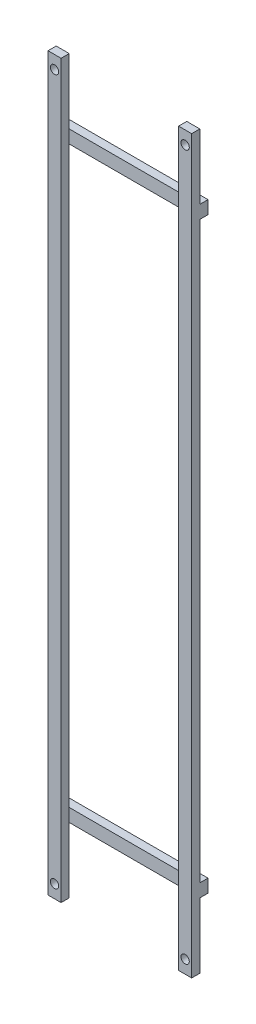
ISO-10303-21;
HEADER;
FILE_DESCRIPTION(('STEP AP214'),'2;1');
FILE_NAME('part.step','',(''),(''),'','','');
FILE_SCHEMA(('AUTOMOTIVE_DESIGN { 1 0 10303 214 1 1 1 1 }'));
ENDSEC;
DATA;
#1=APPLICATION_CONTEXT('core data for automotive mechanical design processes');
#2=APPLICATION_PROTOCOL_DEFINITION('international standard','automotive_design',2000,#1);
#3=PRODUCT_CONTEXT('',#1,'mechanical');
#4=PRODUCT('Part','Part','',(#3));
#5=PRODUCT_RELATED_PRODUCT_CATEGORY('part','',(#4));
#6=PRODUCT_DEFINITION_FORMATION('','',#4);
#7=PRODUCT_DEFINITION_CONTEXT('part definition',#1,'design');
#8=PRODUCT_DEFINITION('design','',#6,#7);
#9=PRODUCT_DEFINITION_SHAPE('','',#8);
#10=(LENGTH_UNIT() NAMED_UNIT(*) SI_UNIT(.MILLI.,.METRE.));
#11=(NAMED_UNIT(*) PLANE_ANGLE_UNIT() SI_UNIT($,.RADIAN.));
#12=(NAMED_UNIT(*) SI_UNIT($,.STERADIAN.) SOLID_ANGLE_UNIT());
#13=UNCERTAINTY_MEASURE_WITH_UNIT(LENGTH_MEASURE(1.E-05),#10,'distance_accuracy_value','');
#14=(GEOMETRIC_REPRESENTATION_CONTEXT(3) GLOBAL_UNCERTAINTY_ASSIGNED_CONTEXT((#13)) GLOBAL_UNIT_ASSIGNED_CONTEXT((#10,
#11,#12)) REPRESENTATION_CONTEXT('',''));
#15=CARTESIAN_POINT('',(0.,0.,0.));
#16=DIRECTION('',(0.,0.,1.));
#17=DIRECTION('',(1.,0.,0.));
#18=AXIS2_PLACEMENT_3D('',#15,#16,#17);
#19=CARTESIAN_POINT('',(220.,-997.383525535419,81.5788462871536));
#20=DIRECTION('',(0.,0.,1.));
#21=DIRECTION('',(1.,0.,0.));
#22=AXIS2_PLACEMENT_3D('',#19,#20,#21);
#23=PLANE('',#22);
#24=DIRECTION('',(-1.,0.,0.));
#25=VECTOR('',#24,1.);
#26=CARTESIAN_POINT('',(220.,762.616474464581,81.5788462871536));
#27=LINE('',#26,#25);
#28=CARTESIAN_POINT('',(220.,762.616474464581,81.5788462871536));
#29=VERTEX_POINT('',#28);
#30=CARTESIAN_POINT('',(180.,762.616474464581,81.5788462871536));
#31=VERTEX_POINT('',#30);
#32=EDGE_CURVE('E363',#29,#31,#27,.T.);
#33=ORIENTED_EDGE('',*,*,#32,.F.);
#34=DIRECTION('',(0.,1.,0.));
#35=VECTOR('',#34,1.);
#36=CARTESIAN_POINT('',(220.,-997.383525535419,81.5788462871536));
#37=LINE('',#36,#35);
#38=CARTESIAN_POINT('',(220.,-997.383525535419,81.5788462871536));
#39=VERTEX_POINT('',#38);
#40=EDGE_CURVE('E323',#39,#29,#37,.T.);
#41=ORIENTED_EDGE('',*,*,#40,.F.);
#42=DIRECTION('',(-1.,0.,0.));
#43=VECTOR('',#42,1.);
#44=CARTESIAN_POINT('',(220.,-997.383525535419,81.5788462871536));
#45=LINE('',#44,#43);
#46=CARTESIAN_POINT('',(180.,-997.383525535419,81.5788462871536));
#47=VERTEX_POINT('',#46);
#48=EDGE_CURVE('E326',#39,#47,#45,.T.);
#49=ORIENTED_EDGE('',*,*,#48,.T.);
#50=DIRECTION('',(0.,1.,0.));
#51=VECTOR('',#50,1.);
#52=CARTESIAN_POINT('',(180.,-997.383525535419,81.5788462871536));
#53=LINE('',#52,#51);
#54=EDGE_CURVE('E322',#47,#31,#53,.T.);
#55=ORIENTED_EDGE('',*,*,#54,.T.);
#56=EDGE_LOOP('',(#33,#41,#49,#55));
#57=FACE_BOUND('',#56,.T.);
#58=ADVANCED_FACE('F35',(#57),#23,.F.);
#59=CARTESIAN_POINT('',(200.,962.616474464581,81.5788462871535));
#60=DIRECTION('',(0.,0.,1.));
#61=DIRECTION('',(-1.,0.,0.));
#62=AXIS2_PLACEMENT_3D('',#59,#60,#61);
#63=CIRCLE('',#62,12.7);
#64=CARTESIAN_POINT('',(187.3,962.616474464581,81.5788462871535));
#65=VERTEX_POINT('',#64);
#66=EDGE_CURVE('E207',#65,#65,#63,.T.);
#67=ORIENTED_EDGE('',*,*,#66,.T.);
#68=EDGE_LOOP('',(#67));
#69=FACE_BOUND('',#68,.T.);
#70=DIRECTION('',(1.,0.,0.));
#71=VECTOR('',#70,1.);
#72=CARTESIAN_POINT('',(220.,802.616474464581,81.5788462871536));
#73=LINE('',#72,#71);
#74=CARTESIAN_POINT('',(180.,802.616474464581,81.5788462871536));
#75=VERTEX_POINT('',#74);
#76=CARTESIAN_POINT('',(220.,802.616474464581,81.5788462871536));
#77=VERTEX_POINT('',#76);
#78=EDGE_CURVE('E361',#75,#77,#73,.T.);
#79=ORIENTED_EDGE('',*,*,#78,.F.);
#80=CARTESIAN_POINT('',(180.,1002.61647446458,81.5788462871535));
#81=VERTEX_POINT('',#80);
#82=EDGE_CURVE('E317',#75,#81,#53,.T.);
#83=ORIENTED_EDGE('',*,*,#82,.T.);
#84=DIRECTION('',(-1.,0.,0.));
#85=VECTOR('',#84,1.);
#86=CARTESIAN_POINT('',(180.,1002.61647446458,81.5788462871535));
#87=LINE('',#86,#85);
#88=CARTESIAN_POINT('',(220.,1002.61647446458,81.5788462871535));
#89=VERTEX_POINT('',#88);
#90=EDGE_CURVE('E213',#89,#81,#87,.T.);
#91=ORIENTED_EDGE('',*,*,#90,.F.);
#92=EDGE_CURVE('E321',#77,#89,#37,.T.);
#93=ORIENTED_EDGE('',*,*,#92,.F.);
#94=EDGE_LOOP('',(#79,#83,#91,#93));
#95=FACE_BOUND('',#94,.T.);
#96=ADVANCED_FACE('F360',(#69,#95),#23,.F.);
#97=CARTESIAN_POINT('',(-3.45826310094282E-13,652.150576606261,81.5788462871536));
#98=DIRECTION('',(0.,0.,-1.));
#99=DIRECTION('',(-1.,0.,0.));
#100=AXIS2_PLACEMENT_3D('',#97,#98,#99);
#101=PLANE('',#100);
#102=DIRECTION('',(0.,-1.,0.));
#103=VECTOR('',#102,1.);
#104=CARTESIAN_POINT('',(-220.,-1237.38352553542,81.5788462871536));
#105=LINE('',#104,#103);
#106=CARTESIAN_POINT('',(-220.,762.616474464581,81.5788462871536));
#107=VERTEX_POINT('',#106);
#108=CARTESIAN_POINT('',(-220.,-997.383525535419,81.5788462871536));
#109=VERTEX_POINT('',#108);
#110=EDGE_CURVE('E275',#107,#109,#105,.T.);
#111=ORIENTED_EDGE('',*,*,#110,.F.);
#112=CARTESIAN_POINT('',(-180.,762.616474464581,81.5788462871536));
#113=VERTEX_POINT('',#112);
#114=EDGE_CURVE('E198',#113,#107,#27,.T.);
#115=ORIENTED_EDGE('',*,*,#114,.F.);
#116=DIRECTION('',(0.,1.,0.));
#117=VECTOR('',#116,1.);
#118=CARTESIAN_POINT('',(-180.,602.616474464581,81.5788462871536));
#119=LINE('',#118,#117);
#120=CARTESIAN_POINT('',(-180.,-997.383525535419,81.5788462871536));
#121=VERTEX_POINT('',#120);
#122=EDGE_CURVE('E383',#121,#113,#119,.T.);
#123=ORIENTED_EDGE('',*,*,#122,.F.);
#124=DIRECTION('',(1.,0.,0.));
#125=VECTOR('',#124,1.);
#126=CARTESIAN_POINT('',(-220.,-997.383525535419,81.5788462871536));
#127=LINE('',#126,#125);
#128=EDGE_CURVE('E301',#109,#121,#127,.T.);
#129=ORIENTED_EDGE('',*,*,#128,.F.);
#130=EDGE_LOOP('',(#111,#115,#123,#129));
#131=FACE_BOUND('',#130,.T.);
#132=ADVANCED_FACE('F381',(#131),#101,.T.);
#133=CARTESIAN_POINT('',(-200.,962.616474464581,81.5788462871535));
#134=DIRECTION('',(0.,0.,1.));
#135=DIRECTION('',(-1.,0.,0.));
#136=AXIS2_PLACEMENT_3D('',#133,#134,#135);
#137=CIRCLE('',#136,12.7000000000001);
#138=CARTESIAN_POINT('',(-212.7,962.616474464581,81.5788462871535));
#139=VERTEX_POINT('',#138);
#140=EDGE_CURVE('E225',#139,#139,#137,.T.);
#141=ORIENTED_EDGE('',*,*,#140,.T.);
#142=EDGE_LOOP('',(#141));
#143=FACE_BOUND('',#142,.T.);
#144=CARTESIAN_POINT('',(-180.,802.616474464581,81.5788462871536));
#145=VERTEX_POINT('',#144);
#146=CARTESIAN_POINT('',(-180.,1002.61647446458,81.5788462871535));
#147=VERTEX_POINT('',#146);
#148=EDGE_CURVE('E280',#145,#147,#119,.T.);
#149=ORIENTED_EDGE('',*,*,#148,.F.);
#150=CARTESIAN_POINT('',(-220.,802.616474464581,81.5788462871536));
#151=VERTEX_POINT('',#150);
#152=EDGE_CURVE('E59',#151,#145,#73,.T.);
#153=ORIENTED_EDGE('',*,*,#152,.F.);
#154=CARTESIAN_POINT('',(-220.,1002.61647446458,81.5788462871535));
#155=VERTEX_POINT('',#154);
#156=EDGE_CURVE('E276',#155,#151,#105,.T.);
#157=ORIENTED_EDGE('',*,*,#156,.F.);
#158=DIRECTION('',(-1.,0.,0.));
#159=VECTOR('',#158,1.);
#160=CARTESIAN_POINT('',(-220.,1002.61647446458,81.5788462871535));
#161=LINE('',#160,#159);
#162=EDGE_CURVE('E231',#147,#155,#161,.T.);
#163=ORIENTED_EDGE('',*,*,#162,.F.);
#164=EDGE_LOOP('',(#149,#153,#157,#163));
#165=FACE_BOUND('',#164,.T.);
#166=ADVANCED_FACE('F398',(#143,#165),#101,.T.);
#167=CARTESIAN_POINT('',(-220.,-997.383525535419,81.5788462871536));
#168=DIRECTION('',(0.,0.,-1.));
#169=DIRECTION('',(0.,1.,0.));
#170=AXIS2_PLACEMENT_3D('',#167,#168,#169);
#171=PLANE('',#170);
#172=CARTESIAN_POINT('',(-180.,-1037.38352553542,81.5788462871536));
#173=VERTEX_POINT('',#172);
#174=EDGE_CURVE('E285',#173,#121,#119,.T.);
#175=ORIENTED_EDGE('',*,*,#174,.F.);
#176=DIRECTION('',(1.,0.,0.));
#177=VECTOR('',#176,1.);
#178=CARTESIAN_POINT('',(-220.,-1037.38352553542,81.5788462871536));
#179=LINE('',#178,#177);
#180=CARTESIAN_POINT('',(180.,-1037.38352553542,81.5788462871535));
#181=VERTEX_POINT('',#180);
#182=EDGE_CURVE('E295',#173,#181,#179,.T.);
#183=ORIENTED_EDGE('',*,*,#182,.T.);
#184=DIRECTION('',(0.,1.,0.));
#185=VECTOR('',#184,1.);
#186=CARTESIAN_POINT('',(180.,-997.383525535419,81.5788462871536));
#187=LINE('',#186,#185);
#188=EDGE_CURVE('E289',#181,#47,#187,.T.);
#189=ORIENTED_EDGE('',*,*,#188,.T.);
#190=EDGE_CURVE('E300',#121,#47,#127,.T.);
#191=ORIENTED_EDGE('',*,*,#190,.F.);
#192=EDGE_LOOP('',(#175,#183,#189,#191));
#193=FACE_BOUND('',#192,.T.);
#194=ADVANCED_FACE('F420',(#193),#171,.F.);
#195=CARTESIAN_POINT('',(180.,652.150576606261,-198.421153712846));
#196=DIRECTION('',(-1.,0.,0.));
#197=DIRECTION('',(0.,0.,1.));
#198=AXIS2_PLACEMENT_3D('',#195,#196,#197);
#199=PLANE('',#198);
#200=DIRECTION('',(0.,-1.,0.));
#201=VECTOR('',#200,1.);
#202=CARTESIAN_POINT('',(180.,652.150576606261,106.578846287154));
#203=LINE('',#202,#201);
#204=CARTESIAN_POINT('',(180.,1002.61647446458,106.578846287154));
#205=VERTEX_POINT('',#204);
#206=CARTESIAN_POINT('',(180.,-1237.38352553542,106.578846287153));
#207=VERTEX_POINT('',#206);
#208=EDGE_CURVE('E254',#205,#207,#203,.T.);
#209=ORIENTED_EDGE('',*,*,#208,.F.);
#210=DIRECTION('',(0.,0.,1.));
#211=VECTOR('',#210,1.);
#212=CARTESIAN_POINT('',(180.,1002.61647446458,81.5788462871535));
#213=LINE('',#212,#211);
#214=EDGE_CURVE('E219',#81,#205,#213,.T.);
#215=ORIENTED_EDGE('',*,*,#214,.F.);
#216=ORIENTED_EDGE('',*,*,#82,.F.);
#217=DIRECTION('',(0.,-1.,0.));
#218=VECTOR('',#217,1.);
#219=CARTESIAN_POINT('',(180.,652.150576606261,81.5788462871536));
#220=LINE('',#219,#218);
#221=EDGE_CURVE('E199',#75,#31,#220,.T.);
#222=ORIENTED_EDGE('',*,*,#221,.T.);
#223=ORIENTED_EDGE('',*,*,#54,.F.);
#224=ORIENTED_EDGE('',*,*,#188,.F.);
#225=DIRECTION('',(0.,1.,0.));
#226=VECTOR('',#225,1.);
#227=CARTESIAN_POINT('',(180.,-1237.38352553542,81.5788462871535));
#228=LINE('',#227,#226);
#229=CARTESIAN_POINT('',(180.,-1237.38352553542,81.5788462871535));
#230=VERTEX_POINT('',#229);
#231=EDGE_CURVE('E304',#230,#181,#228,.T.);
#232=ORIENTED_EDGE('',*,*,#231,.F.);
#233=DIRECTION('',(0.,0.,1.));
#234=VECTOR('',#233,1.);
#235=CARTESIAN_POINT('',(180.,-1237.38352553542,-198.421153712846));
#236=LINE('',#235,#234);
#237=EDGE_CURVE('E331',#230,#207,#236,.T.);
#238=ORIENTED_EDGE('',*,*,#237,.T.);
#239=EDGE_LOOP('',(#209,#215,#216,#222,#223,#224,#232,#238));
#240=FACE_BOUND('',#239,.T.);
#241=ADVANCED_FACE('F338',(#240),#199,.T.);
#242=CARTESIAN_POINT('',(220.,-1237.38352553542,-198.421153712846));
#243=DIRECTION('',(0.,-1.,0.));
#244=DIRECTION('',(0.,0.,-1.));
#245=AXIS2_PLACEMENT_3D('',#242,#243,#244);
#246=PLANE('',#245);
#247=DIRECTION('',(1.,0.,0.));
#248=VECTOR('',#247,1.);
#249=CARTESIAN_POINT('',(220.,-1237.38352553542,106.578846287153));
#250=LINE('',#249,#248);
#251=CARTESIAN_POINT('',(220.,-1237.38352553542,106.578846287154));
#252=VERTEX_POINT('',#251);
#253=EDGE_CURVE('E256',#207,#252,#250,.T.);
#254=ORIENTED_EDGE('',*,*,#253,.F.);
#255=ORIENTED_EDGE('',*,*,#237,.F.);
#256=DIRECTION('',(-1.,0.,0.));
#257=VECTOR('',#256,1.);
#258=CARTESIAN_POINT('',(220.,-1237.38352553542,81.5788462871535));
#259=LINE('',#258,#257);
#260=CARTESIAN_POINT('',(220.,-1237.38352553542,81.5788462871535));
#261=VERTEX_POINT('',#260);
#262=EDGE_CURVE('E311',#261,#230,#259,.T.);
#263=ORIENTED_EDGE('',*,*,#262,.F.);
#264=DIRECTION('',(0.,0.,1.));
#265=VECTOR('',#264,1.);
#266=CARTESIAN_POINT('',(220.,-1237.38352553542,-198.421153712846));
#267=LINE('',#266,#265);
#268=EDGE_CURVE('E44',#261,#252,#267,.T.);
#269=ORIENTED_EDGE('',*,*,#268,.T.);
#270=EDGE_LOOP('',(#254,#255,#263,#269));
#271=FACE_BOUND('',#270,.T.);
#272=ADVANCED_FACE('F37',(#271),#246,.T.);
#273=CARTESIAN_POINT('',(220.,652.150576606261,-198.421153712846));
#274=DIRECTION('',(-1.,0.,0.));
#275=DIRECTION('',(0.,0.,1.));
#276=AXIS2_PLACEMENT_3D('',#273,#274,#275);
#277=PLANE('',#276);
#278=ORIENTED_EDGE('',*,*,#40,.T.);
#279=DIRECTION('',(0.,0.,1.));
#280=VECTOR('',#279,1.);
#281=CARTESIAN_POINT('',(220.,762.616474464581,56.5788462871536));
#282=LINE('',#281,#280);
#283=CARTESIAN_POINT('',(220.,762.616474464581,56.5788462871536));
#284=VERTEX_POINT('',#283);
#285=EDGE_CURVE('E369',#284,#29,#282,.T.);
#286=ORIENTED_EDGE('',*,*,#285,.F.);
#287=DIRECTION('',(0.,-1.,0.));
#288=VECTOR('',#287,1.);
#289=CARTESIAN_POINT('',(220.,762.616474464581,56.5788462871536));
#290=LINE('',#289,#288);
#291=CARTESIAN_POINT('',(220.,802.616474464581,56.5788462871536));
#292=VERTEX_POINT('',#291);
#293=EDGE_CURVE('E190',#292,#284,#290,.T.);
#294=ORIENTED_EDGE('',*,*,#293,.F.);
#295=DIRECTION('',(0.,0.,1.));
#296=VECTOR('',#295,1.);
#297=CARTESIAN_POINT('',(220.,802.616474464581,56.5788462871536));
#298=LINE('',#297,#296);
#299=EDGE_CURVE('E51',#292,#77,#298,.T.);
#300=ORIENTED_EDGE('',*,*,#299,.T.);
#301=ORIENTED_EDGE('',*,*,#92,.T.);
#302=DIRECTION('',(0.,0.,1.));
#303=VECTOR('',#302,1.);
#304=CARTESIAN_POINT('',(220.,1002.61647446458,81.5788462871535));
#305=LINE('',#304,#303);
#306=CARTESIAN_POINT('',(220.,1002.61647446458,106.578846287154));
#307=VERTEX_POINT('',#306);
#308=EDGE_CURVE('E216',#89,#307,#305,.T.);
#309=ORIENTED_EDGE('',*,*,#308,.T.);
#310=DIRECTION('',(0.,1.,0.));
#311=VECTOR('',#310,1.);
#312=CARTESIAN_POINT('',(220.,823.041268335871,106.578846287154));
#313=LINE('',#312,#311);
#314=EDGE_CURVE('E240',#252,#307,#313,.T.);
#315=ORIENTED_EDGE('',*,*,#314,.F.);
#316=ORIENTED_EDGE('',*,*,#268,.F.);
#317=DIRECTION('',(0.,1.,0.));
#318=VECTOR('',#317,1.);
#319=CARTESIAN_POINT('',(220.,-1237.38352553542,81.5788462871535));
#320=LINE('',#319,#318);
#321=CARTESIAN_POINT('',(220.,-1037.38352553542,81.5788462871535));
#322=VERTEX_POINT('',#321);
#323=EDGE_CURVE('E305',#261,#322,#320,.T.);
#324=ORIENTED_EDGE('',*,*,#323,.T.);
#325=DIRECTION('',(0.,0.,-1.));
#326=VECTOR('',#325,1.);
#327=CARTESIAN_POINT('',(220.,-1037.38352553542,81.5788462871535));
#328=LINE('',#327,#326);
#329=CARTESIAN_POINT('',(220.,-1037.38352553542,56.5788462871538));
#330=VERTEX_POINT('',#329);
#331=EDGE_CURVE('E308',#322,#330,#328,.T.);
#332=ORIENTED_EDGE('',*,*,#331,.T.);
#333=DIRECTION('',(0.,-1.,0.));
#334=VECTOR('',#333,1.);
#335=CARTESIAN_POINT('',(220.,866.387601976079,56.5788462871538));
#336=LINE('',#335,#334);
#337=CARTESIAN_POINT('',(220.,-997.38352553542,56.5788462871535));
#338=VERTEX_POINT('',#337);
#339=EDGE_CURVE('E258',#338,#330,#336,.T.);
#340=ORIENTED_EDGE('',*,*,#339,.F.);
#341=DIRECTION('',(0.,0.,1.));
#342=VECTOR('',#341,1.);
#343=CARTESIAN_POINT('',(220.,-997.383525535419,-198.421153712846));
#344=LINE('',#343,#342);
#345=EDGE_CURVE('E319',#338,#39,#344,.T.);
#346=ORIENTED_EDGE('',*,*,#345,.T.);
#347=EDGE_LOOP('',(#278,#286,#294,#300,#301,#309,#315,#316,#324,#332,#340,#346));
#348=FACE_BOUND('',#347,.T.);
#349=ADVANCED_FACE('F349',(#348),#277,.F.);
#350=CARTESIAN_POINT('',(220.,-997.383525535419,-198.421153712846));
#351=DIRECTION('',(0.,-1.,0.));
#352=DIRECTION('',(1.,0.,0.));
#353=AXIS2_PLACEMENT_3D('',#350,#351,#352);
#354=PLANE('',#353);
#355=ORIENTED_EDGE('',*,*,#345,.F.);
#356=DIRECTION('',(-1.,0.,0.));
#357=VECTOR('',#356,1.);
#358=CARTESIAN_POINT('',(220.,-997.383525535419,56.5788462871535));
#359=LINE('',#358,#357);
#360=CARTESIAN_POINT('',(-220.,-997.383525535419,56.5788462871536));
#361=VERTEX_POINT('',#360);
#362=EDGE_CURVE('E263',#338,#361,#359,.T.);
#363=ORIENTED_EDGE('',*,*,#362,.T.);
#364=DIRECTION('',(0.,0.,-1.));
#365=VECTOR('',#364,1.);
#366=CARTESIAN_POINT('',(-220.,-997.383525535419,-198.421153712846));
#367=LINE('',#366,#365);
#368=EDGE_CURVE('E290',#109,#361,#367,.T.);
#369=ORIENTED_EDGE('',*,*,#368,.F.);
#370=ORIENTED_EDGE('',*,*,#128,.T.);
#371=ORIENTED_EDGE('',*,*,#190,.T.);
#372=ORIENTED_EDGE('',*,*,#48,.F.);
#373=EDGE_LOOP('',(#355,#363,#369,#370,#371,#372));
#374=FACE_BOUND('',#373,.T.);
#375=ADVANCED_FACE('F423',(#374),#354,.F.);
#376=CARTESIAN_POINT('',(-220.,652.150576606261,-198.421153712846));
#377=DIRECTION('',(1.,0.,0.));
#378=DIRECTION('',(0.,0.,-1.));
#379=AXIS2_PLACEMENT_3D('',#376,#377,#378);
#380=PLANE('',#379);
#381=DIRECTION('',(0.,1.,0.));
#382=VECTOR('',#381,1.);
#383=CARTESIAN_POINT('',(-220.,652.150576606261,106.578846287154));
#384=LINE('',#383,#382);
#385=CARTESIAN_POINT('',(-220.,-1237.38352553542,106.578846287153));
#386=VERTEX_POINT('',#385);
#387=CARTESIAN_POINT('',(-220.,1002.61647446458,106.578846287154));
#388=VERTEX_POINT('',#387);
#389=EDGE_CURVE('E252',#386,#388,#384,.T.);
#390=ORIENTED_EDGE('',*,*,#389,.T.);
#391=DIRECTION('',(0.,0.,1.));
#392=VECTOR('',#391,1.);
#393=CARTESIAN_POINT('',(-220.,1002.61647446458,81.5788462871535));
#394=LINE('',#393,#392);
#395=EDGE_CURVE('E237',#155,#388,#394,.T.);
#396=ORIENTED_EDGE('',*,*,#395,.F.);
#397=ORIENTED_EDGE('',*,*,#156,.T.);
#398=DIRECTION('',(0.,0.,1.));
#399=VECTOR('',#398,1.);
#400=CARTESIAN_POINT('',(-220.,802.616474464581,56.5788462871536));
#401=LINE('',#400,#399);
#402=CARTESIAN_POINT('',(-220.,802.616474464581,56.5788462871536));
#403=VERTEX_POINT('',#402);
#404=EDGE_CURVE('E182',#403,#151,#401,.T.);
#405=ORIENTED_EDGE('',*,*,#404,.F.);
#406=DIRECTION('',(0.,1.,0.));
#407=VECTOR('',#406,1.);
#408=CARTESIAN_POINT('',(-220.,762.616474464581,56.5788462871536));
#409=LINE('',#408,#407);
#410=CARTESIAN_POINT('',(-220.,762.616474464581,56.5788462871536));
#411=VERTEX_POINT('',#410);
#412=EDGE_CURVE('E175',#411,#403,#409,.T.);
#413=ORIENTED_EDGE('',*,*,#412,.F.);
#414=DIRECTION('',(0.,0.,1.));
#415=VECTOR('',#414,1.);
#416=CARTESIAN_POINT('',(-220.,762.616474464581,56.5788462871536));
#417=LINE('',#416,#415);
#418=EDGE_CURVE('E179',#411,#107,#417,.T.);
#419=ORIENTED_EDGE('',*,*,#418,.T.);
#420=ORIENTED_EDGE('',*,*,#110,.T.);
#421=ORIENTED_EDGE('',*,*,#368,.T.);
#422=DIRECTION('',(0.,-1.,0.));
#423=VECTOR('',#422,1.);
#424=CARTESIAN_POINT('',(-220.,652.150576606261,56.5788462871538));
#425=LINE('',#424,#423);
#426=CARTESIAN_POINT('',(-220.,-1037.38352553542,56.5788462871535));
#427=VERTEX_POINT('',#426);
#428=EDGE_CURVE('E260',#361,#427,#425,.T.);
#429=ORIENTED_EDGE('',*,*,#428,.T.);
#430=DIRECTION('',(0.,0.,1.));
#431=VECTOR('',#430,1.);
#432=CARTESIAN_POINT('',(-220.,-1037.38352553542,81.5788462871536));
#433=LINE('',#432,#431);
#434=CARTESIAN_POINT('',(-220.,-1037.38352553542,81.5788462871536));
#435=VERTEX_POINT('',#434);
#436=EDGE_CURVE('E293',#427,#435,#433,.T.);
#437=ORIENTED_EDGE('',*,*,#436,.T.);
#438=CARTESIAN_POINT('',(-220.,-1237.38352553542,81.5788462871536));
#439=VERTEX_POINT('',#438);
#440=EDGE_CURVE('E272',#435,#439,#105,.T.);
#441=ORIENTED_EDGE('',*,*,#440,.T.);
#442=DIRECTION('',(0.,0.,-1.));
#443=VECTOR('',#442,1.);
#444=CARTESIAN_POINT('',(-220.,-1237.38352553542,121.578846287154));
#445=LINE('',#444,#443);
#446=EDGE_CURVE('E287',#386,#439,#445,.T.);
#447=ORIENTED_EDGE('',*,*,#446,.F.);
#448=EDGE_LOOP('',(#390,#396,#397,#405,#413,#419,#420,#421,#429,#437,#441,#447));
#449=FACE_BOUND('',#448,.T.);
#450=ADVANCED_FACE('F177',(#449),#380,.F.);
#451=CARTESIAN_POINT('',(220.,-1037.38352553542,81.5788462871535));
#452=DIRECTION('',(0.,1.,0.));
#453=DIRECTION('',(-1.,0.,0.));
#454=AXIS2_PLACEMENT_3D('',#451,#452,#453);
#455=PLANE('',#454);
#456=ORIENTED_EDGE('',*,*,#436,.F.);
#457=DIRECTION('',(1.,0.,0.));
#458=VECTOR('',#457,1.);
#459=CARTESIAN_POINT('',(220.,-1037.38352553542,56.5788462871535));
#460=LINE('',#459,#458);
#461=EDGE_CURVE('E11',#427,#330,#460,.T.);
#462=ORIENTED_EDGE('',*,*,#461,.T.);
#463=ORIENTED_EDGE('',*,*,#331,.F.);
#464=DIRECTION('',(-1.,0.,0.));
#465=VECTOR('',#464,1.);
#466=CARTESIAN_POINT('',(220.,-1037.38352553542,81.5788462871535));
#467=LINE('',#466,#465);
#468=EDGE_CURVE('E314',#322,#181,#467,.T.);
#469=ORIENTED_EDGE('',*,*,#468,.T.);
#470=ORIENTED_EDGE('',*,*,#182,.F.);
#471=EDGE_CURVE('E298',#435,#173,#179,.T.);
#472=ORIENTED_EDGE('',*,*,#471,.F.);
#473=EDGE_LOOP('',(#456,#462,#463,#469,#470,#472));
#474=FACE_BOUND('',#473,.T.);
#475=ADVANCED_FACE('F417',(#474),#455,.F.);
#476=CARTESIAN_POINT('',(220.,-1237.38352553542,81.5788462871535));
#477=DIRECTION('',(0.,0.,1.));
#478=DIRECTION('',(1.,0.,0.));
#479=AXIS2_PLACEMENT_3D('',#476,#477,#478);
#480=PLANE('',#479);
#481=CARTESIAN_POINT('',(200.,-1197.38352553542,81.5788462871535));
#482=DIRECTION('',(0.,0.,1.));
#483=DIRECTION('',(1.,0.,0.));
#484=AXIS2_PLACEMENT_3D('',#481,#482,#483);
#485=CIRCLE('',#484,12.7);
#486=CARTESIAN_POINT('',(212.7,-1197.38352553542,81.5788462871535));
#487=VERTEX_POINT('',#486);
#488=EDGE_CURVE('E266',#487,#487,#485,.T.);
#489=ORIENTED_EDGE('',*,*,#488,.T.);
#490=EDGE_LOOP('',(#489));
#491=FACE_BOUND('',#490,.T.);
#492=ORIENTED_EDGE('',*,*,#231,.T.);
#493=ORIENTED_EDGE('',*,*,#468,.F.);
#494=ORIENTED_EDGE('',*,*,#323,.F.);
#495=ORIENTED_EDGE('',*,*,#262,.T.);
#496=EDGE_LOOP('',(#492,#493,#494,#495));
#497=FACE_BOUND('',#496,.T.);
#498=ADVANCED_FACE('F427',(#491,#497),#480,.F.);
#499=CARTESIAN_POINT('',(-200.,-1197.38352553542,81.5788462871536));
#500=DIRECTION('',(0.,0.,-1.));
#501=DIRECTION('',(0.,1.,0.));
#502=AXIS2_PLACEMENT_3D('',#499,#500,#501);
#503=CIRCLE('',#502,12.7);
#504=CARTESIAN_POINT('',(-200.,-1184.68352553542,81.5788462871536));
#505=VERTEX_POINT('',#504);
#506=EDGE_CURVE('E269',#505,#505,#503,.T.);
#507=ORIENTED_EDGE('',*,*,#506,.F.);
#508=EDGE_LOOP('',(#507));
#509=FACE_BOUND('',#508,.T.);
#510=ORIENTED_EDGE('',*,*,#471,.T.);
#511=CARTESIAN_POINT('',(-180.,-1237.38352553542,81.5788462871536));
#512=VERTEX_POINT('',#511);
#513=EDGE_CURVE('E281',#512,#173,#119,.T.);
#514=ORIENTED_EDGE('',*,*,#513,.F.);
#515=DIRECTION('',(1.,0.,0.));
#516=VECTOR('',#515,1.);
#517=CARTESIAN_POINT('',(-180.,-1237.38352553542,81.5788462871536));
#518=LINE('',#517,#516);
#519=EDGE_CURVE('E277',#439,#512,#518,.T.);
#520=ORIENTED_EDGE('',*,*,#519,.F.);
#521=ORIENTED_EDGE('',*,*,#440,.F.);
#522=EDGE_LOOP('',(#510,#514,#520,#521));
#523=FACE_BOUND('',#522,.T.);
#524=ADVANCED_FACE('F412',(#509,#523),#101,.T.);
#525=CARTESIAN_POINT('',(-180.,-1237.38352553542,121.578846287154));
#526=DIRECTION('',(0.,1.,0.));
#527=DIRECTION('',(0.,0.,1.));
#528=AXIS2_PLACEMENT_3D('',#525,#526,#527);
#529=PLANE('',#528);
#530=DIRECTION('',(0.,0.,-1.));
#531=VECTOR('',#530,1.);
#532=CARTESIAN_POINT('',(-180.,-1237.38352553542,121.578846287154));
#533=LINE('',#532,#531);
#534=CARTESIAN_POINT('',(-180.,-1237.38352553542,106.578846287153));
#535=VERTEX_POINT('',#534);
#536=EDGE_CURVE('E284',#535,#512,#533,.T.);
#537=ORIENTED_EDGE('',*,*,#536,.F.);
#538=DIRECTION('',(-1.,0.,0.));
#539=VECTOR('',#538,1.);
#540=CARTESIAN_POINT('',(-180.,-1237.38352553542,106.578846287153));
#541=LINE('',#540,#539);
#542=EDGE_CURVE('E249',#535,#386,#541,.T.);
#543=ORIENTED_EDGE('',*,*,#542,.T.);
#544=ORIENTED_EDGE('',*,*,#446,.T.);
#545=ORIENTED_EDGE('',*,*,#519,.T.);
#546=EDGE_LOOP('',(#537,#543,#544,#545));
#547=FACE_BOUND('',#546,.T.);
#548=ADVANCED_FACE('F409',(#547),#529,.F.);
#549=CARTESIAN_POINT('',(-180.,602.616474464581,121.578846287154));
#550=DIRECTION('',(-1.,0.,0.));
#551=DIRECTION('',(0.,0.,1.));
#552=AXIS2_PLACEMENT_3D('',#549,#550,#551);
#553=PLANE('',#552);
#554=ORIENTED_EDGE('',*,*,#122,.T.);
#555=EDGE_CURVE('E388',#113,#145,#119,.T.);
#556=ORIENTED_EDGE('',*,*,#555,.T.);
#557=ORIENTED_EDGE('',*,*,#148,.T.);
#558=DIRECTION('',(0.,0.,1.));
#559=VECTOR('',#558,1.);
#560=CARTESIAN_POINT('',(-180.,1002.61647446458,81.5788462871535));
#561=LINE('',#560,#559);
#562=CARTESIAN_POINT('',(-180.,1002.61647446458,106.578846287154));
#563=VERTEX_POINT('',#562);
#564=EDGE_CURVE('E234',#147,#563,#561,.T.);
#565=ORIENTED_EDGE('',*,*,#564,.T.);
#566=DIRECTION('',(0.,-1.,0.));
#567=VECTOR('',#566,1.);
#568=CARTESIAN_POINT('',(-180.,602.616474464581,106.578846287154));
#569=LINE('',#568,#567);
#570=EDGE_CURVE('E247',#563,#535,#569,.T.);
#571=ORIENTED_EDGE('',*,*,#570,.T.);
#572=ORIENTED_EDGE('',*,*,#536,.T.);
#573=ORIENTED_EDGE('',*,*,#513,.T.);
#574=ORIENTED_EDGE('',*,*,#174,.T.);
#575=EDGE_LOOP('',(#554,#556,#557,#565,#571,#572,#573,#574));
#576=FACE_BOUND('',#575,.T.);
#577=ADVANCED_FACE('F387',(#576),#553,.F.);
#578=CARTESIAN_POINT('',(-200.,-1197.38352553542,81.5788462871536));
#579=DIRECTION('',(0.,0.,-1.));
#580=DIRECTION('',(0.,1.,0.));
#581=AXIS2_PLACEMENT_3D('',#578,#579,#580);
#582=CYLINDRICAL_SURFACE('',#581,12.7);
#583=CARTESIAN_POINT('',(-200.,-1197.38352553542,106.578846287153));
#584=DIRECTION('',(0.,0.,-1.));
#585=DIRECTION('',(0.,1.,0.));
#586=AXIS2_PLACEMENT_3D('',#583,#584,#585);
#587=CIRCLE('',#586,12.7);
#588=CARTESIAN_POINT('',(-200.,-1184.68352553542,106.578846287153));
#589=VERTEX_POINT('',#588);
#590=EDGE_CURVE('E244',#589,#589,#587,.F.);
#591=ORIENTED_EDGE('',*,*,#590,.T.);
#592=EDGE_LOOP('',(#591));
#593=FACE_BOUND('',#592,.T.);
#594=ORIENTED_EDGE('',*,*,#506,.T.);
#595=EDGE_LOOP('',(#594));
#596=FACE_BOUND('',#595,.T.);
#597=ADVANCED_FACE('F463',(#593,#596),#582,.F.);
#598=CARTESIAN_POINT('',(200.,-1197.38352553542,121.578846287154));
#599=DIRECTION('',(0.,0.,1.));
#600=DIRECTION('',(1.,0.,0.));
#601=AXIS2_PLACEMENT_3D('',#598,#599,#600);
#602=CYLINDRICAL_SURFACE('',#601,12.7);
#603=CARTESIAN_POINT('',(200.,-1197.38352553542,106.578846287153));
#604=DIRECTION('',(0.,0.,-1.));
#605=DIRECTION('',(0.,1.,0.));
#606=AXIS2_PLACEMENT_3D('',#603,#604,#605);
#607=CIRCLE('',#606,12.7);
#608=CARTESIAN_POINT('',(200.,-1184.68352553542,106.578846287153));
#609=VERTEX_POINT('',#608);
#610=EDGE_CURVE('E39',#609,#609,#607,.F.);
#611=ORIENTED_EDGE('',*,*,#610,.T.);
#612=EDGE_LOOP('',(#611));
#613=FACE_BOUND('',#612,.T.);
#614=ORIENTED_EDGE('',*,*,#488,.F.);
#615=EDGE_LOOP('',(#614));
#616=FACE_BOUND('',#615,.T.);
#617=ADVANCED_FACE('F468',(#613,#616),#602,.F.);
#618=CARTESIAN_POINT('',(-380.000000000001,866.387601976079,56.5788462871538));
#619=DIRECTION('',(0.,0.,1.));
#620=DIRECTION('',(0.,-1.,0.));
#621=AXIS2_PLACEMENT_3D('',#618,#619,#620);
#622=PLANE('',#621);
#623=ORIENTED_EDGE('',*,*,#339,.T.);
#624=ORIENTED_EDGE('',*,*,#461,.F.);
#625=ORIENTED_EDGE('',*,*,#428,.F.);
#626=ORIENTED_EDGE('',*,*,#362,.F.);
#627=EDGE_LOOP('',(#623,#624,#625,#626));
#628=FACE_BOUND('',#627,.T.);
#629=ADVANCED_FACE('F425',(#628),#622,.F.);
#630=CARTESIAN_POINT('',(-380.000000000001,823.041268335871,106.578846287154));
#631=DIRECTION('',(0.,0.,-1.));
#632=DIRECTION('',(0.,1.,0.));
#633=AXIS2_PLACEMENT_3D('',#630,#631,#632);
#634=PLANE('',#633);
#635=ORIENTED_EDGE('',*,*,#314,.T.);
#636=DIRECTION('',(-1.,0.,0.));
#637=VECTOR('',#636,1.);
#638=CARTESIAN_POINT('',(180.,1002.61647446458,106.578846287154));
#639=LINE('',#638,#637);
#640=EDGE_CURVE('E210',#307,#205,#639,.T.);
#641=ORIENTED_EDGE('',*,*,#640,.T.);
#642=ORIENTED_EDGE('',*,*,#208,.T.);
#643=ORIENTED_EDGE('',*,*,#253,.T.);
#644=EDGE_LOOP('',(#635,#641,#642,#643));
#645=FACE_BOUND('',#644,.T.);
#646=ORIENTED_EDGE('',*,*,#610,.F.);
#647=EDGE_LOOP('',(#646));
#648=FACE_BOUND('',#647,.T.);
#649=CARTESIAN_POINT('',(200.,962.616474464581,106.578846287154));
#650=DIRECTION('',(0.,0.,1.));
#651=DIRECTION('',(-1.,0.,0.));
#652=AXIS2_PLACEMENT_3D('',#649,#650,#651);
#653=CIRCLE('',#652,12.7);
#654=CARTESIAN_POINT('',(187.3,962.616474464581,106.578846287154));
#655=VERTEX_POINT('',#654);
#656=EDGE_CURVE('E202',#655,#655,#653,.T.);
#657=ORIENTED_EDGE('',*,*,#656,.F.);
#658=EDGE_LOOP('',(#657));
#659=FACE_BOUND('',#658,.T.);
#660=ADVANCED_FACE('F347',(#645,#648,#659),#634,.F.);
#661=ORIENTED_EDGE('',*,*,#590,.F.);
#662=EDGE_LOOP('',(#661));
#663=FACE_BOUND('',#662,.T.);
#664=ORIENTED_EDGE('',*,*,#570,.F.);
#665=DIRECTION('',(-1.,0.,0.));
#666=VECTOR('',#665,1.);
#667=CARTESIAN_POINT('',(-220.,1002.61647446458,106.578846287154));
#668=LINE('',#667,#666);
#669=EDGE_CURVE('E228',#563,#388,#668,.T.);
#670=ORIENTED_EDGE('',*,*,#669,.T.);
#671=ORIENTED_EDGE('',*,*,#389,.F.);
#672=ORIENTED_EDGE('',*,*,#542,.F.);
#673=EDGE_LOOP('',(#664,#670,#671,#672));
#674=FACE_BOUND('',#673,.T.);
#675=CARTESIAN_POINT('',(-200.,962.616474464581,106.578846287154));
#676=DIRECTION('',(0.,0.,1.));
#677=DIRECTION('',(-1.,0.,0.));
#678=AXIS2_PLACEMENT_3D('',#675,#676,#677);
#679=CIRCLE('',#678,12.7000000000001);
#680=CARTESIAN_POINT('',(-212.7,962.616474464581,106.578846287154));
#681=VERTEX_POINT('',#680);
#682=EDGE_CURVE('E222',#681,#681,#679,.T.);
#683=ORIENTED_EDGE('',*,*,#682,.F.);
#684=EDGE_LOOP('',(#683));
#685=FACE_BOUND('',#684,.T.);
#686=ADVANCED_FACE('F402',(#663,#674,#685),#634,.F.);
#687=CARTESIAN_POINT('',(-220.,1002.61647446458,81.5788462871535));
#688=DIRECTION('',(0.,1.,0.));
#689=DIRECTION('',(0.,0.,1.));
#690=AXIS2_PLACEMENT_3D('',#687,#688,#689);
#691=PLANE('',#690);
#692=ORIENTED_EDGE('',*,*,#669,.F.);
#693=ORIENTED_EDGE('',*,*,#564,.F.);
#694=ORIENTED_EDGE('',*,*,#162,.T.);
#695=ORIENTED_EDGE('',*,*,#395,.T.);
#696=EDGE_LOOP('',(#692,#693,#694,#695));
#697=FACE_BOUND('',#696,.T.);
#698=ADVANCED_FACE('F397',(#697),#691,.T.);
#699=CARTESIAN_POINT('',(-200.,962.616474464581,81.5788462871535));
#700=DIRECTION('',(0.,0.,1.));
#701=DIRECTION('',(1.,0.,0.));
#702=AXIS2_PLACEMENT_3D('',#699,#700,#701);
#703=CYLINDRICAL_SURFACE('',#702,12.7000000000001);
#704=ORIENTED_EDGE('',*,*,#140,.F.);
#705=EDGE_LOOP('',(#704));
#706=FACE_BOUND('',#705,.T.);
#707=ORIENTED_EDGE('',*,*,#682,.T.);
#708=EDGE_LOOP('',(#707));
#709=FACE_BOUND('',#708,.T.);
#710=ADVANCED_FACE('F480',(#706,#709),#703,.F.);
#711=CARTESIAN_POINT('',(180.,1002.61647446458,81.5788462871535));
#712=DIRECTION('',(0.,1.,0.));
#713=DIRECTION('',(0.,0.,1.));
#714=AXIS2_PLACEMENT_3D('',#711,#712,#713);
#715=PLANE('',#714);
#716=ORIENTED_EDGE('',*,*,#640,.F.);
#717=ORIENTED_EDGE('',*,*,#308,.F.);
#718=ORIENTED_EDGE('',*,*,#90,.T.);
#719=ORIENTED_EDGE('',*,*,#214,.T.);
#720=EDGE_LOOP('',(#716,#717,#718,#719));
#721=FACE_BOUND('',#720,.T.);
#722=ADVANCED_FACE('F355',(#721),#715,.T.);
#723=CARTESIAN_POINT('',(200.,962.616474464581,81.5788462871535));
#724=DIRECTION('',(0.,0.,1.));
#725=DIRECTION('',(1.,0.,0.));
#726=AXIS2_PLACEMENT_3D('',#723,#724,#725);
#727=CYLINDRICAL_SURFACE('',#726,12.7);
#728=ORIENTED_EDGE('',*,*,#66,.F.);
#729=EDGE_LOOP('',(#728));
#730=FACE_BOUND('',#729,.T.);
#731=ORIENTED_EDGE('',*,*,#656,.T.);
#732=EDGE_LOOP('',(#731));
#733=FACE_BOUND('',#732,.T.);
#734=ADVANCED_FACE('F486',(#730,#733),#727,.F.);
#735=CARTESIAN_POINT('',(0.,0.,81.5788462871536));
#736=DIRECTION('',(0.,0.,-1.));
#737=DIRECTION('',(-1.,0.,0.));
#738=AXIS2_PLACEMENT_3D('',#735,#736,#737);
#739=PLANE('',#738);
#740=ORIENTED_EDGE('',*,*,#221,.F.);
#741=EDGE_CURVE('E362',#145,#75,#73,.T.);
#742=ORIENTED_EDGE('',*,*,#741,.F.);
#743=ORIENTED_EDGE('',*,*,#555,.F.);
#744=EDGE_CURVE('E365',#31,#113,#27,.T.);
#745=ORIENTED_EDGE('',*,*,#744,.F.);
#746=EDGE_LOOP('',(#740,#742,#743,#745));
#747=FACE_BOUND('',#746,.T.);
#748=ADVANCED_FACE('F489',(#747),#739,.F.);
#749=CARTESIAN_POINT('',(220.,762.616474464581,56.5788462871536));
#750=DIRECTION('',(0.,1.,0.));
#751=DIRECTION('',(0.,0.,1.));
#752=AXIS2_PLACEMENT_3D('',#749,#750,#751);
#753=PLANE('',#752);
#754=ORIENTED_EDGE('',*,*,#32,.T.);
#755=ORIENTED_EDGE('',*,*,#744,.T.);
#756=ORIENTED_EDGE('',*,*,#114,.T.);
#757=ORIENTED_EDGE('',*,*,#418,.F.);
#758=DIRECTION('',(-1.,0.,0.));
#759=VECTOR('',#758,1.);
#760=CARTESIAN_POINT('',(220.,762.616474464581,56.5788462871536));
#761=LINE('',#760,#759);
#762=EDGE_CURVE('E186',#284,#411,#761,.T.);
#763=ORIENTED_EDGE('',*,*,#762,.F.);
#764=ORIENTED_EDGE('',*,*,#285,.T.);
#765=EDGE_LOOP('',(#754,#755,#756,#757,#763,#764));
#766=FACE_BOUND('',#765,.T.);
#767=ADVANCED_FACE('F195',(#766),#753,.F.);
#768=CARTESIAN_POINT('',(220.,802.616474464581,56.5788462871536));
#769=DIRECTION('',(0.,-1.,0.));
#770=DIRECTION('',(0.,0.,-1.));
#771=AXIS2_PLACEMENT_3D('',#768,#769,#770);
#772=PLANE('',#771);
#773=ORIENTED_EDGE('',*,*,#152,.T.);
#774=ORIENTED_EDGE('',*,*,#741,.T.);
#775=ORIENTED_EDGE('',*,*,#78,.T.);
#776=ORIENTED_EDGE('',*,*,#299,.F.);
#777=DIRECTION('',(1.,0.,0.));
#778=VECTOR('',#777,1.);
#779=CARTESIAN_POINT('',(220.,802.616474464581,56.5788462871536));
#780=LINE('',#779,#778);
#781=EDGE_CURVE('E185',#403,#292,#780,.T.);
#782=ORIENTED_EDGE('',*,*,#781,.F.);
#783=ORIENTED_EDGE('',*,*,#404,.T.);
#784=EDGE_LOOP('',(#773,#774,#775,#776,#782,#783));
#785=FACE_BOUND('',#784,.T.);
#786=ADVANCED_FACE('F372',(#785),#772,.F.);
#787=CARTESIAN_POINT('',(0.,0.,56.5788462871536));
#788=DIRECTION('',(0.,0.,-1.));
#789=DIRECTION('',(-1.,0.,0.));
#790=AXIS2_PLACEMENT_3D('',#787,#788,#789);
#791=PLANE('',#790);
#792=ORIENTED_EDGE('',*,*,#762,.T.);
#793=ORIENTED_EDGE('',*,*,#412,.T.);
#794=ORIENTED_EDGE('',*,*,#781,.T.);
#795=ORIENTED_EDGE('',*,*,#293,.T.);
#796=EDGE_LOOP('',(#792,#793,#794,#795));
#797=FACE_BOUND('',#796,.T.);
#798=ADVANCED_FACE('F189',(#797),#791,.T.);
#799=CLOSED_SHELL('',(#58,#96,#132,#166,#194,#241,#272,#349,#375,#450,#475,#498,#524,#548,#577,
#597,#617,#629,#660,#686,#698,#710,#722,#734,#748,#767,#786,#798));
#800=MANIFOLD_SOLID_BREP('B2',#799);
#801=ADVANCED_BREP_SHAPE_REPRESENTATION('',(#18,#800),#14);
#802=SHAPE_DEFINITION_REPRESENTATION(#9,#801);
ENDSEC;
END-ISO-10303-21;
